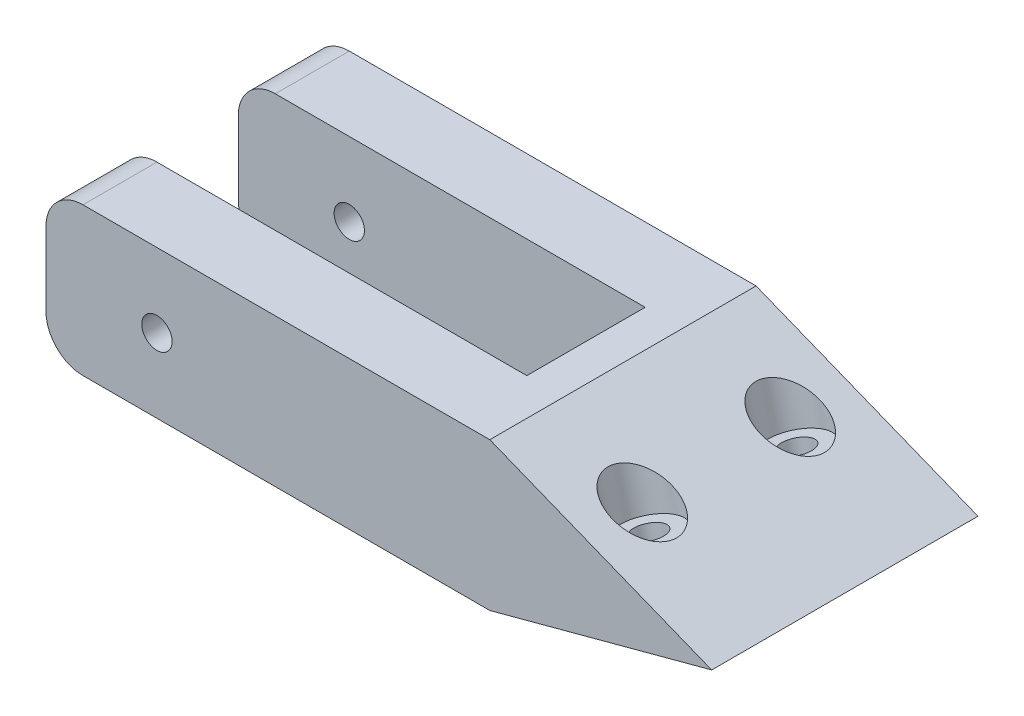
ISO-10303-21;
HEADER;
FILE_DESCRIPTION(('STEP AP214'),'2;1');
FILE_NAME('part.step','',(''),(''),'','','');
FILE_SCHEMA(('AUTOMOTIVE_DESIGN { 1 0 10303 214 1 1 1 1 }'));
ENDSEC;
DATA;
#1=APPLICATION_CONTEXT('core data for automotive mechanical design processes');
#2=APPLICATION_PROTOCOL_DEFINITION('international standard','automotive_design',2000,#1);
#3=PRODUCT_CONTEXT('',#1,'mechanical');
#4=PRODUCT('Part','Part','',(#3));
#5=PRODUCT_RELATED_PRODUCT_CATEGORY('part','',(#4));
#6=PRODUCT_DEFINITION_FORMATION('','',#4);
#7=PRODUCT_DEFINITION_CONTEXT('part definition',#1,'design');
#8=PRODUCT_DEFINITION('design','',#6,#7);
#9=PRODUCT_DEFINITION_SHAPE('','',#8);
#10=(LENGTH_UNIT() NAMED_UNIT(*) SI_UNIT(.MILLI.,.METRE.));
#11=(NAMED_UNIT(*) PLANE_ANGLE_UNIT() SI_UNIT($,.RADIAN.));
#12=(NAMED_UNIT(*) SI_UNIT($,.STERADIAN.) SOLID_ANGLE_UNIT());
#13=UNCERTAINTY_MEASURE_WITH_UNIT(LENGTH_MEASURE(1.E-05),#10,'distance_accuracy_value','');
#14=(GEOMETRIC_REPRESENTATION_CONTEXT(3) GLOBAL_UNCERTAINTY_ASSIGNED_CONTEXT((#13)) GLOBAL_UNIT_ASSIGNED_CONTEXT((#10,
#11,#12)) REPRESENTATION_CONTEXT('',''));
#15=CARTESIAN_POINT('',(0.,0.,0.));
#16=DIRECTION('',(0.,0.,1.));
#17=DIRECTION('',(1.,0.,0.));
#18=AXIS2_PLACEMENT_3D('',#15,#16,#17);
#19=CARTESIAN_POINT('',(51.491557731899,27.8176271469422,-2.));
#20=DIRECTION('',(0.258819045102521,-0.965925826289068,0.));
#21=DIRECTION('',(0.965925826289068,0.258819045102521,0.));
#22=AXIS2_PLACEMENT_3D('',#19,#20,#21);
#23=CYLINDRICAL_SURFACE('',#22,4.00000000000001);
#24=CARTESIAN_POINT('',(57.6133351267968,4.97084287655714,-2.));
#25=DIRECTION('',(0.370363447941102,0.928886923381516,0.));
#26=DIRECTION('',(0.928886923381516,-0.370363447941102,0.));
#27=AXIS2_PLACEMENT_3D('',#24,#25,#26);
#28=ELLIPSE('',#27,4.99139760662046,4.00000000000001);
#29=CARTESIAN_POINT('',(62.2497790929843,3.12221164892422,-2.));
#30=VERTEX_POINT('',#29);
#31=EDGE_CURVE('E209',#30,#30,#28,.F.);
#32=ORIENTED_EDGE('',*,*,#31,.F.);
#33=EDGE_LOOP('',(#32));
#34=FACE_BOUND('',#33,.T.);
#35=CARTESIAN_POINT('',(58.4405602448438,1.88359670670842,-2.));
#36=DIRECTION('',(0.258819045102521,-0.965925826289068,0.));
#37=DIRECTION('',(0.965925826289068,0.258819045102521,0.));
#38=AXIS2_PLACEMENT_3D('',#35,#36,#37);
#39=CIRCLE('',#38,4.00000000000001);
#40=CARTESIAN_POINT('',(62.3042635500001,2.9188728871185,-2.));
#41=VERTEX_POINT('',#40);
#42=EDGE_CURVE('E11',#41,#41,#39,.F.);
#43=ORIENTED_EDGE('',*,*,#42,.F.);
#44=EDGE_LOOP('',(#43));
#45=FACE_BOUND('',#44,.T.);
#46=ADVANCED_FACE('F43',(#34,#45),#23,.F.);
#47=CARTESIAN_POINT('',(0.,10.,-10.));
#48=DIRECTION('',(0.,-1.,0.));
#49=DIRECTION('',(1.,0.,0.));
#50=AXIS2_PLACEMENT_3D('',#47,#48,#49);
#51=PLANE('',#50);
#52=DIRECTION('',(1.,0.,0.));
#53=VECTOR('',#52,1.);
#54=CARTESIAN_POINT('',(0.,10.,0.));
#55=LINE('',#54,#53);
#56=CARTESIAN_POINT('',(-10.,10.,0.));
#57=VERTEX_POINT('',#56);
#58=CARTESIAN_POINT('',(40.,10.,0.));
#59=VERTEX_POINT('',#58);
#60=EDGE_CURVE('E150',#57,#59,#55,.T.);
#61=ORIENTED_EDGE('',*,*,#60,.T.);
#62=DIRECTION('',(0.,0.,-1.));
#63=VECTOR('',#62,1.);
#64=CARTESIAN_POINT('',(40.,10.,8.));
#65=LINE('',#64,#63);
#66=CARTESIAN_POINT('',(40.,10.,16.));
#67=VERTEX_POINT('',#66);
#68=EDGE_CURVE('E154',#67,#59,#65,.T.);
#69=ORIENTED_EDGE('',*,*,#68,.F.);
#70=DIRECTION('',(1.,0.,0.));
#71=VECTOR('',#70,1.);
#72=CARTESIAN_POINT('',(0.,10.,16.));
#73=LINE('',#72,#71);
#74=CARTESIAN_POINT('',(-10.,10.,16.));
#75=VERTEX_POINT('',#74);
#76=EDGE_CURVE('E259',#75,#67,#73,.T.);
#77=ORIENTED_EDGE('',*,*,#76,.F.);
#78=DIRECTION('',(0.,0.,-1.));
#79=VECTOR('',#78,1.);
#80=CARTESIAN_POINT('',(-10.,10.,26.));
#81=LINE('',#80,#79);
#82=CARTESIAN_POINT('',(-10.,10.,26.));
#83=VERTEX_POINT('',#82);
#84=EDGE_CURVE('E226',#83,#75,#81,.T.);
#85=ORIENTED_EDGE('',*,*,#84,.F.);
#86=DIRECTION('',(1.,0.,0.));
#87=VECTOR('',#86,1.);
#88=CARTESIAN_POINT('',(0.,10.,26.));
#89=LINE('',#88,#87);
#90=CARTESIAN_POINT('',(45.,10.,26.));
#91=VERTEX_POINT('',#90);
#92=EDGE_CURVE('E246',#83,#91,#89,.T.);
#93=ORIENTED_EDGE('',*,*,#92,.T.);
#94=DIRECTION('',(0.,0.,1.));
#95=VECTOR('',#94,1.);
#96=CARTESIAN_POINT('',(45.,10.,-10.));
#97=LINE('',#96,#95);
#98=CARTESIAN_POINT('',(45.,10.,-10.));
#99=VERTEX_POINT('',#98);
#100=EDGE_CURVE('E53',#99,#91,#97,.T.);
#101=ORIENTED_EDGE('',*,*,#100,.F.);
#102=DIRECTION('',(1.,0.,0.));
#103=VECTOR('',#102,1.);
#104=CARTESIAN_POINT('',(0.,10.,-10.));
#105=LINE('',#104,#103);
#106=CARTESIAN_POINT('',(-10.,10.,-10.));
#107=VERTEX_POINT('',#106);
#108=EDGE_CURVE('E69',#107,#99,#105,.T.);
#109=ORIENTED_EDGE('',*,*,#108,.F.);
#110=DIRECTION('',(0.,0.,1.));
#111=VECTOR('',#110,1.);
#112=CARTESIAN_POINT('',(-10.,10.,-10.));
#113=LINE('',#112,#111);
#114=EDGE_CURVE('E100',#107,#57,#113,.T.);
#115=ORIENTED_EDGE('',*,*,#114,.T.);
#116=EDGE_LOOP('',(#61,#69,#77,#85,#93,#101,#109,#115));
#117=FACE_BOUND('',#116,.T.);
#118=ADVANCED_FACE('F45',(#117),#51,.F.);
#119=CARTESIAN_POINT('',(9.61286639759677,24.1094685303859,-10.));
#120=DIRECTION('',(0.370363447941102,0.928886923381516,0.));
#121=DIRECTION('',(-0.928886923381516,0.370363447941102,0.));
#122=AXIS2_PLACEMENT_3D('',#119,#120,#121);
#123=PLANE('',#122);
#124=ORIENTED_EDGE('',*,*,#31,.T.);
#125=EDGE_LOOP('',(#124));
#126=FACE_BOUND('',#125,.T.);
#127=ORIENTED_EDGE('',*,*,#100,.T.);
#128=DIRECTION('',(-0.928886923381516,0.370363447941102,0.));
#129=VECTOR('',#128,1.);
#130=CARTESIAN_POINT('',(9.61286639759677,24.1094685303859,26.));
#131=LINE('',#130,#129);
#132=CARTESIAN_POINT('',(75.,-1.96152422706629,26.));
#133=VERTEX_POINT('',#132);
#134=EDGE_CURVE('E231',#133,#91,#131,.T.);
#135=ORIENTED_EDGE('',*,*,#134,.F.);
#136=DIRECTION('',(0.,0.,1.));
#137=VECTOR('',#136,1.);
#138=CARTESIAN_POINT('',(75.,-1.96152422706629,-10.));
#139=LINE('',#138,#137);
#140=CARTESIAN_POINT('',(75.,-1.96152422706629,-10.));
#141=VERTEX_POINT('',#140);
#142=EDGE_CURVE('E129',#141,#133,#139,.T.);
#143=ORIENTED_EDGE('',*,*,#142,.F.);
#144=DIRECTION('',(-0.928886923381516,0.370363447941102,0.));
#145=VECTOR('',#144,1.);
#146=CARTESIAN_POINT('',(9.61286639759677,24.1094685303859,-10.));
#147=LINE('',#146,#145);
#148=EDGE_CURVE('E136',#141,#99,#147,.T.);
#149=ORIENTED_EDGE('',*,*,#148,.T.);
#150=EDGE_LOOP('',(#127,#135,#143,#149));
#151=FACE_BOUND('',#150,.T.);
#152=CARTESIAN_POINT('',(57.6133351267968,4.97084287655714,18.));
#153=DIRECTION('',(-0.370363447941102,-0.928886923381516,0.));
#154=DIRECTION('',(0.928886923381516,-0.370363447941102,0.));
#155=AXIS2_PLACEMENT_3D('',#152,#153,#154);
#156=ELLIPSE('',#155,4.99139760662046,4.00000000000001);
#157=CARTESIAN_POINT('',(62.2497790929843,3.12221164892422,18.));
#158=VERTEX_POINT('',#157);
#159=EDGE_CURVE('E290',#158,#158,#156,.F.);
#160=ORIENTED_EDGE('',*,*,#159,.F.);
#161=EDGE_LOOP('',(#160));
#162=FACE_BOUND('',#161,.T.);
#163=ADVANCED_FACE('F337',(#126,#151,#162),#123,.T.);
#164=CARTESIAN_POINT('',(5.51442841485016,-20.5801270189222,-10.));
#165=DIRECTION('',(0.258819045102522,-0.965925826289068,0.));
#166=DIRECTION('',(0.965925826289068,0.258819045102522,0.));
#167=AXIS2_PLACEMENT_3D('',#164,#165,#166);
#168=PLANE('',#167);
#169=ORIENTED_EDGE('',*,*,#142,.T.);
#170=DIRECTION('',(0.965925826289068,0.258819045102522,0.));
#171=VECTOR('',#170,1.);
#172=CARTESIAN_POINT('',(5.51442841485016,-20.5801270189222,26.));
#173=LINE('',#172,#171);
#174=CARTESIAN_POINT('',(45.,-10.,26.));
#175=VERTEX_POINT('',#174);
#176=EDGE_CURVE('E123',#175,#133,#173,.T.);
#177=ORIENTED_EDGE('',*,*,#176,.F.);
#178=DIRECTION('',(0.,0.,1.));
#179=VECTOR('',#178,1.);
#180=CARTESIAN_POINT('',(45.,-10.,-10.));
#181=LINE('',#180,#179);
#182=CARTESIAN_POINT('',(45.,-10.,-10.));
#183=VERTEX_POINT('',#182);
#184=EDGE_CURVE('E115',#183,#175,#181,.T.);
#185=ORIENTED_EDGE('',*,*,#184,.F.);
#186=DIRECTION('',(0.965925826289068,0.258819045102522,0.));
#187=VECTOR('',#186,1.);
#188=CARTESIAN_POINT('',(5.51442841485016,-20.5801270189222,-10.));
#189=LINE('',#188,#187);
#190=EDGE_CURVE('E120',#183,#141,#189,.T.);
#191=ORIENTED_EDGE('',*,*,#190,.T.);
#192=EDGE_LOOP('',(#169,#177,#185,#191));
#193=FACE_BOUND('',#192,.T.);
#194=CARTESIAN_POINT('',(60.511112605664,-5.84380990360413,-2.));
#195=DIRECTION('',(0.258819045102521,-0.965925826289068,0.));
#196=DIRECTION('',(0.965925826289068,0.258819045102521,0.));
#197=AXIS2_PLACEMENT_3D('',#194,#195,#196);
#198=CIRCLE('',#197,2.10000000000001);
#199=CARTESIAN_POINT('',(62.539556840871,-5.30028990888883,-2.));
#200=VERTEX_POINT('',#199);
#201=EDGE_CURVE('E214',#200,#200,#198,.T.);
#202=ORIENTED_EDGE('',*,*,#201,.F.);
#203=EDGE_LOOP('',(#202));
#204=FACE_BOUND('',#203,.T.);
#205=CARTESIAN_POINT('',(60.511112605664,-5.84380990360413,18.));
#206=DIRECTION('',(-0.258819045102521,0.965925826289068,0.));
#207=DIRECTION('',(0.965925826289068,0.258819045102521,0.));
#208=AXIS2_PLACEMENT_3D('',#205,#206,#207);
#209=CIRCLE('',#208,2.10000000000001);
#210=CARTESIAN_POINT('',(62.539556840871,-5.30028990888883,18.));
#211=VERTEX_POINT('',#210);
#212=EDGE_CURVE('E295',#211,#211,#209,.T.);
#213=ORIENTED_EDGE('',*,*,#212,.T.);
#214=EDGE_LOOP('',(#213));
#215=FACE_BOUND('',#214,.T.);
#216=ADVANCED_FACE('F118',(#193,#204,#215),#168,.T.);
#217=CARTESIAN_POINT('',(0.,-10.,-10.));
#218=DIRECTION('',(0.,-1.,0.));
#219=DIRECTION('',(1.,0.,0.));
#220=AXIS2_PLACEMENT_3D('',#217,#218,#219);
#221=PLANE('',#220);
#222=DIRECTION('',(1.,0.,0.));
#223=VECTOR('',#222,1.);
#224=CARTESIAN_POINT('',(0.,-10.,0.));
#225=LINE('',#224,#223);
#226=CARTESIAN_POINT('',(-10.,-10.,0.));
#227=VERTEX_POINT('',#226);
#228=CARTESIAN_POINT('',(40.,-10.,0.));
#229=VERTEX_POINT('',#228);
#230=EDGE_CURVE('E166',#227,#229,#225,.T.);
#231=ORIENTED_EDGE('',*,*,#230,.F.);
#232=DIRECTION('',(0.,0.,1.));
#233=VECTOR('',#232,1.);
#234=CARTESIAN_POINT('',(-10.,-10.,-10.));
#235=LINE('',#234,#233);
#236=CARTESIAN_POINT('',(-10.,-10.,-10.));
#237=VERTEX_POINT('',#236);
#238=EDGE_CURVE('E92',#237,#227,#235,.T.);
#239=ORIENTED_EDGE('',*,*,#238,.F.);
#240=DIRECTION('',(1.,0.,0.));
#241=VECTOR('',#240,1.);
#242=CARTESIAN_POINT('',(0.,-10.,-10.));
#243=LINE('',#242,#241);
#244=EDGE_CURVE('E134',#237,#183,#243,.T.);
#245=ORIENTED_EDGE('',*,*,#244,.T.);
#246=ORIENTED_EDGE('',*,*,#184,.T.);
#247=DIRECTION('',(1.,0.,0.));
#248=VECTOR('',#247,1.);
#249=CARTESIAN_POINT('',(0.,-10.,26.));
#250=LINE('',#249,#248);
#251=CARTESIAN_POINT('',(-10.,-10.,26.));
#252=VERTEX_POINT('',#251);
#253=EDGE_CURVE('E269',#252,#175,#250,.T.);
#254=ORIENTED_EDGE('',*,*,#253,.F.);
#255=DIRECTION('',(0.,0.,-1.));
#256=VECTOR('',#255,1.);
#257=CARTESIAN_POINT('',(-10.,-10.,26.));
#258=LINE('',#257,#256);
#259=CARTESIAN_POINT('',(-10.,-10.,16.));
#260=VERTEX_POINT('',#259);
#261=EDGE_CURVE('E225',#252,#260,#258,.T.);
#262=ORIENTED_EDGE('',*,*,#261,.T.);
#263=DIRECTION('',(1.,0.,0.));
#264=VECTOR('',#263,1.);
#265=CARTESIAN_POINT('',(0.,-10.,16.));
#266=LINE('',#265,#264);
#267=CARTESIAN_POINT('',(40.,-10.,16.));
#268=VERTEX_POINT('',#267);
#269=EDGE_CURVE('E242',#260,#268,#266,.T.);
#270=ORIENTED_EDGE('',*,*,#269,.T.);
#271=DIRECTION('',(0.,0.,-1.));
#272=VECTOR('',#271,1.);
#273=CARTESIAN_POINT('',(40.,-10.,8.));
#274=LINE('',#273,#272);
#275=EDGE_CURVE('E203',#268,#229,#274,.T.);
#276=ORIENTED_EDGE('',*,*,#275,.T.);
#277=EDGE_LOOP('',(#231,#239,#245,#246,#254,#262,#270,#276));
#278=FACE_BOUND('',#277,.T.);
#279=ADVANCED_FACE('F139',(#278),#221,.T.);
#280=CARTESIAN_POINT('',(-10.,-5.,-10.));
#281=DIRECTION('',(0.,0.,1.));
#282=DIRECTION('',(1.,0.,0.));
#283=AXIS2_PLACEMENT_3D('',#280,#281,#282);
#284=CYLINDRICAL_SURFACE('',#283,5.);
#285=CARTESIAN_POINT('',(-10.,-5.,0.));
#286=DIRECTION('',(0.,0.,1.));
#287=DIRECTION('',(1.,0.,0.));
#288=AXIS2_PLACEMENT_3D('',#285,#286,#287);
#289=CIRCLE('',#288,5.);
#290=CARTESIAN_POINT('',(-15.,-4.99999999999993,0.));
#291=VERTEX_POINT('',#290);
#292=EDGE_CURVE('E162',#291,#227,#289,.T.);
#293=ORIENTED_EDGE('',*,*,#292,.F.);
#294=DIRECTION('',(0.,0.,1.));
#295=VECTOR('',#294,1.);
#296=CARTESIAN_POINT('',(-15.,-4.99999999999993,-10.));
#297=LINE('',#296,#295);
#298=CARTESIAN_POINT('',(-15.,-4.99999999999993,-10.));
#299=VERTEX_POINT('',#298);
#300=EDGE_CURVE('E176',#299,#291,#297,.T.);
#301=ORIENTED_EDGE('',*,*,#300,.F.);
#302=CARTESIAN_POINT('',(-10.,-5.,-10.));
#303=DIRECTION('',(0.,0.,1.));
#304=DIRECTION('',(1.,0.,0.));
#305=AXIS2_PLACEMENT_3D('',#302,#303,#304);
#306=CIRCLE('',#305,5.);
#307=EDGE_CURVE('E141',#299,#237,#306,.T.);
#308=ORIENTED_EDGE('',*,*,#307,.T.);
#309=ORIENTED_EDGE('',*,*,#238,.T.);
#310=EDGE_LOOP('',(#293,#301,#308,#309));
#311=FACE_BOUND('',#310,.T.);
#312=ADVANCED_FACE('F194',(#311),#284,.T.);
#313=CARTESIAN_POINT('',(-15.,0.,-10.));
#314=DIRECTION('',(-1.,0.,0.));
#315=DIRECTION('',(0.,0.,1.));
#316=AXIS2_PLACEMENT_3D('',#313,#314,#315);
#317=PLANE('',#316);
#318=DIRECTION('',(0.,-1.,0.));
#319=VECTOR('',#318,1.);
#320=CARTESIAN_POINT('',(-15.,0.,0.));
#321=LINE('',#320,#319);
#322=CARTESIAN_POINT('',(-15.,4.99999999999993,0.));
#323=VERTEX_POINT('',#322);
#324=EDGE_CURVE('E158',#323,#291,#321,.T.);
#325=ORIENTED_EDGE('',*,*,#324,.F.);
#326=DIRECTION('',(0.,0.,1.));
#327=VECTOR('',#326,1.);
#328=CARTESIAN_POINT('',(-15.,4.99999999999993,-10.));
#329=LINE('',#328,#327);
#330=CARTESIAN_POINT('',(-15.,4.99999999999993,-10.));
#331=VERTEX_POINT('',#330);
#332=EDGE_CURVE('E179',#331,#323,#329,.T.);
#333=ORIENTED_EDGE('',*,*,#332,.F.);
#334=DIRECTION('',(0.,-1.,0.));
#335=VECTOR('',#334,1.);
#336=CARTESIAN_POINT('',(-15.,0.,-10.));
#337=LINE('',#336,#335);
#338=EDGE_CURVE('E144',#331,#299,#337,.T.);
#339=ORIENTED_EDGE('',*,*,#338,.T.);
#340=ORIENTED_EDGE('',*,*,#300,.T.);
#341=EDGE_LOOP('',(#325,#333,#339,#340));
#342=FACE_BOUND('',#341,.T.);
#343=ADVANCED_FACE('F193',(#342),#317,.T.);
#344=CARTESIAN_POINT('',(-10.,5.,-10.));
#345=DIRECTION('',(0.,0.,1.));
#346=DIRECTION('',(1.,0.,0.));
#347=AXIS2_PLACEMENT_3D('',#344,#345,#346);
#348=CYLINDRICAL_SURFACE('',#347,5.);
#349=CARTESIAN_POINT('',(-10.,5.,0.));
#350=DIRECTION('',(0.,0.,1.));
#351=DIRECTION('',(1.,0.,0.));
#352=AXIS2_PLACEMENT_3D('',#349,#350,#351);
#353=CIRCLE('',#352,5.);
#354=EDGE_CURVE('E153',#57,#323,#353,.T.);
#355=ORIENTED_EDGE('',*,*,#354,.F.);
#356=ORIENTED_EDGE('',*,*,#114,.F.);
#357=CARTESIAN_POINT('',(-10.,5.,-10.));
#358=DIRECTION('',(0.,0.,1.));
#359=DIRECTION('',(1.,0.,0.));
#360=AXIS2_PLACEMENT_3D('',#357,#358,#359);
#361=CIRCLE('',#360,5.);
#362=EDGE_CURVE('E189',#107,#331,#361,.T.);
#363=ORIENTED_EDGE('',*,*,#362,.T.);
#364=ORIENTED_EDGE('',*,*,#332,.T.);
#365=EDGE_LOOP('',(#355,#356,#363,#364));
#366=FACE_BOUND('',#365,.T.);
#367=ADVANCED_FACE('F187',(#366),#348,.T.);
#368=CARTESIAN_POINT('',(0.,0.,-10.));
#369=DIRECTION('',(0.,0.,1.));
#370=DIRECTION('',(1.,0.,0.));
#371=AXIS2_PLACEMENT_3D('',#368,#369,#370);
#372=PLANE('',#371);
#373=ORIENTED_EDGE('',*,*,#108,.T.);
#374=ORIENTED_EDGE('',*,*,#148,.F.);
#375=ORIENTED_EDGE('',*,*,#190,.F.);
#376=ORIENTED_EDGE('',*,*,#244,.F.);
#377=ORIENTED_EDGE('',*,*,#307,.F.);
#378=ORIENTED_EDGE('',*,*,#338,.F.);
#379=ORIENTED_EDGE('',*,*,#362,.F.);
#380=EDGE_LOOP('',(#373,#374,#375,#376,#377,#378,#379));
#381=FACE_BOUND('',#380,.T.);
#382=ADVANCED_FACE('F132',(#381),#372,.F.);
#383=CARTESIAN_POINT('',(0.,0.,0.));
#384=DIRECTION('',(0.,0.,1.));
#385=DIRECTION('',(1.,0.,0.));
#386=AXIS2_PLACEMENT_3D('',#383,#384,#385);
#387=PLANE('',#386);
#388=CARTESIAN_POINT('',(0.,0.,0.));
#389=DIRECTION('',(0.,0.,1.));
#390=DIRECTION('',(1.,0.,0.));
#391=AXIS2_PLACEMENT_3D('',#388,#389,#390);
#392=CIRCLE('',#391,2.05);
#393=CARTESIAN_POINT('',(2.05,0.,0.));
#394=VERTEX_POINT('',#393);
#395=EDGE_CURVE('E299',#394,#394,#392,.F.);
#396=ORIENTED_EDGE('',*,*,#395,.T.);
#397=EDGE_LOOP('',(#396));
#398=FACE_BOUND('',#397,.T.);
#399=DIRECTION('',(0.,-1.,0.));
#400=VECTOR('',#399,1.);
#401=CARTESIAN_POINT('',(40.,0.,0.));
#402=LINE('',#401,#400);
#403=EDGE_CURVE('E60',#59,#229,#402,.T.);
#404=ORIENTED_EDGE('',*,*,#403,.F.);
#405=ORIENTED_EDGE('',*,*,#60,.F.);
#406=ORIENTED_EDGE('',*,*,#354,.T.);
#407=ORIENTED_EDGE('',*,*,#324,.T.);
#408=ORIENTED_EDGE('',*,*,#292,.T.);
#409=ORIENTED_EDGE('',*,*,#230,.T.);
#410=EDGE_LOOP('',(#404,#405,#406,#407,#408,#409));
#411=FACE_BOUND('',#410,.T.);
#412=ADVANCED_FACE('F186',(#398,#411),#387,.T.);
#413=CARTESIAN_POINT('',(40.,0.,8.));
#414=DIRECTION('',(1.,0.,0.));
#415=DIRECTION('',(0.,0.,-1.));
#416=AXIS2_PLACEMENT_3D('',#413,#414,#415);
#417=PLANE('',#416);
#418=ORIENTED_EDGE('',*,*,#403,.T.);
#419=ORIENTED_EDGE('',*,*,#275,.F.);
#420=DIRECTION('',(0.,-1.,0.));
#421=VECTOR('',#420,1.);
#422=CARTESIAN_POINT('',(40.,0.,16.));
#423=LINE('',#422,#421);
#424=EDGE_CURVE('E263',#67,#268,#423,.T.);
#425=ORIENTED_EDGE('',*,*,#424,.F.);
#426=ORIENTED_EDGE('',*,*,#68,.T.);
#427=EDGE_LOOP('',(#418,#419,#425,#426));
#428=FACE_BOUND('',#427,.T.);
#429=ADVANCED_FACE('F344',(#428),#417,.F.);
#430=CARTESIAN_POINT('',(58.4405602448438,1.88359670670842,-2.));
#431=DIRECTION('',(0.258819045102521,-0.965925826289068,0.));
#432=DIRECTION('',(0.965925826289068,0.258819045102521,0.));
#433=AXIS2_PLACEMENT_3D('',#430,#431,#432);
#434=PLANE('',#433);
#435=CARTESIAN_POINT('',(58.4405602448438,1.88359670670842,-2.));
#436=DIRECTION('',(0.258819045102521,-0.965925826289068,0.));
#437=DIRECTION('',(0.965925826289068,0.258819045102521,0.));
#438=AXIS2_PLACEMENT_3D('',#435,#436,#437);
#439=CIRCLE('',#438,2.10000000000001);
#440=CARTESIAN_POINT('',(60.4690044800509,2.42711670142371,-2.));
#441=VERTEX_POINT('',#440);
#442=EDGE_CURVE('E213',#441,#441,#439,.T.);
#443=ORIENTED_EDGE('',*,*,#442,.T.);
#444=EDGE_LOOP('',(#443));
#445=FACE_BOUND('',#444,.T.);
#446=ORIENTED_EDGE('',*,*,#42,.T.);
#447=EDGE_LOOP('',(#446));
#448=FACE_BOUND('',#447,.T.);
#449=ADVANCED_FACE('F342',(#445,#448),#434,.F.);
#450=CARTESIAN_POINT('',(58.4405602448438,1.88359670670842,-2.));
#451=DIRECTION('',(0.258819045102521,-0.965925826289068,0.));
#452=DIRECTION('',(0.965925826289068,0.258819045102521,0.));
#453=AXIS2_PLACEMENT_3D('',#450,#451,#452);
#454=CYLINDRICAL_SURFACE('',#453,2.10000000000001);
#455=ORIENTED_EDGE('',*,*,#442,.F.);
#456=EDGE_LOOP('',(#455));
#457=FACE_BOUND('',#456,.T.);
#458=ORIENTED_EDGE('',*,*,#201,.T.);
#459=EDGE_LOOP('',(#458));
#460=FACE_BOUND('',#459,.T.);
#461=ADVANCED_FACE('F393',(#457,#460),#454,.F.);
#462=CARTESIAN_POINT('',(51.491557731899,27.8176271469422,18.));
#463=DIRECTION('',(0.258819045102521,-0.965925826289068,0.));
#464=DIRECTION('',(0.965925826289068,0.258819045102521,0.));
#465=AXIS2_PLACEMENT_3D('',#462,#463,#464);
#466=CYLINDRICAL_SURFACE('',#465,4.00000000000001);
#467=ORIENTED_EDGE('',*,*,#159,.T.);
#468=EDGE_LOOP('',(#467));
#469=FACE_BOUND('',#468,.T.);
#470=CARTESIAN_POINT('',(58.4405602448438,1.88359670670842,18.));
#471=DIRECTION('',(-0.258819045102521,0.965925826289068,0.));
#472=DIRECTION('',(0.965925826289068,0.258819045102521,0.));
#473=AXIS2_PLACEMENT_3D('',#470,#471,#472);
#474=CIRCLE('',#473,4.00000000000001);
#475=CARTESIAN_POINT('',(62.3042635500001,2.9188728871185,18.));
#476=VERTEX_POINT('',#475);
#477=EDGE_CURVE('E218',#476,#476,#474,.F.);
#478=ORIENTED_EDGE('',*,*,#477,.T.);
#479=EDGE_LOOP('',(#478));
#480=FACE_BOUND('',#479,.T.);
#481=ADVANCED_FACE('F401',(#469,#480),#466,.F.);
#482=CARTESIAN_POINT('',(-10.,-5.,26.));
#483=DIRECTION('',(0.,0.,-1.));
#484=DIRECTION('',(1.,0.,0.));
#485=AXIS2_PLACEMENT_3D('',#482,#483,#484);
#486=CYLINDRICAL_SURFACE('',#485,5.);
#487=CARTESIAN_POINT('',(-10.,-5.,16.));
#488=DIRECTION('',(0.,0.,1.));
#489=DIRECTION('',(1.,0.,0.));
#490=AXIS2_PLACEMENT_3D('',#487,#488,#489);
#491=CIRCLE('',#490,5.);
#492=CARTESIAN_POINT('',(-15.,-4.99999999999993,16.));
#493=VERTEX_POINT('',#492);
#494=EDGE_CURVE('E247',#493,#260,#491,.T.);
#495=ORIENTED_EDGE('',*,*,#494,.T.);
#496=ORIENTED_EDGE('',*,*,#261,.F.);
#497=CARTESIAN_POINT('',(-10.,-5.,26.));
#498=DIRECTION('',(0.,0.,1.));
#499=DIRECTION('',(1.,0.,0.));
#500=AXIS2_PLACEMENT_3D('',#497,#498,#499);
#501=CIRCLE('',#500,5.);
#502=CARTESIAN_POINT('',(-15.,-4.99999999999993,26.));
#503=VERTEX_POINT('',#502);
#504=EDGE_CURVE('E272',#503,#252,#501,.T.);
#505=ORIENTED_EDGE('',*,*,#504,.F.);
#506=DIRECTION('',(0.,0.,-1.));
#507=VECTOR('',#506,1.);
#508=CARTESIAN_POINT('',(-15.,-4.99999999999993,26.));
#509=LINE('',#508,#507);
#510=EDGE_CURVE('E235',#503,#493,#509,.T.);
#511=ORIENTED_EDGE('',*,*,#510,.T.);
#512=EDGE_LOOP('',(#495,#496,#505,#511));
#513=FACE_BOUND('',#512,.T.);
#514=ADVANCED_FACE('F409',(#513),#486,.T.);
#515=CARTESIAN_POINT('',(-15.,0.,26.));
#516=DIRECTION('',(-1.,0.,0.));
#517=DIRECTION('',(0.,0.,-1.));
#518=AXIS2_PLACEMENT_3D('',#515,#516,#517);
#519=PLANE('',#518);
#520=DIRECTION('',(0.,-1.,0.));
#521=VECTOR('',#520,1.);
#522=CARTESIAN_POINT('',(-15.,0.,16.));
#523=LINE('',#522,#521);
#524=CARTESIAN_POINT('',(-15.,4.99999999999993,16.));
#525=VERTEX_POINT('',#524);
#526=EDGE_CURVE('E251',#525,#493,#523,.T.);
#527=ORIENTED_EDGE('',*,*,#526,.T.);
#528=ORIENTED_EDGE('',*,*,#510,.F.);
#529=DIRECTION('',(0.,-1.,0.));
#530=VECTOR('',#529,1.);
#531=CARTESIAN_POINT('',(-15.,0.,26.));
#532=LINE('',#531,#530);
#533=CARTESIAN_POINT('',(-15.,4.99999999999993,26.));
#534=VERTEX_POINT('',#533);
#535=EDGE_CURVE('E276',#534,#503,#532,.T.);
#536=ORIENTED_EDGE('',*,*,#535,.F.);
#537=DIRECTION('',(0.,0.,-1.));
#538=VECTOR('',#537,1.);
#539=CARTESIAN_POINT('',(-15.,4.99999999999993,26.));
#540=LINE('',#539,#538);
#541=EDGE_CURVE('E230',#534,#525,#540,.T.);
#542=ORIENTED_EDGE('',*,*,#541,.T.);
#543=EDGE_LOOP('',(#527,#528,#536,#542));
#544=FACE_BOUND('',#543,.T.);
#545=ADVANCED_FACE('F417',(#544),#519,.T.);
#546=CARTESIAN_POINT('',(-10.,5.,26.));
#547=DIRECTION('',(0.,0.,-1.));
#548=DIRECTION('',(1.,0.,0.));
#549=AXIS2_PLACEMENT_3D('',#546,#547,#548);
#550=CYLINDRICAL_SURFACE('',#549,5.);
#551=CARTESIAN_POINT('',(-10.,5.,16.));
#552=DIRECTION('',(0.,0.,1.));
#553=DIRECTION('',(1.,0.,0.));
#554=AXIS2_PLACEMENT_3D('',#551,#552,#553);
#555=CIRCLE('',#554,5.);
#556=EDGE_CURVE('E255',#75,#525,#555,.T.);
#557=ORIENTED_EDGE('',*,*,#556,.T.);
#558=ORIENTED_EDGE('',*,*,#541,.F.);
#559=CARTESIAN_POINT('',(-10.,5.,26.));
#560=DIRECTION('',(0.,0.,1.));
#561=DIRECTION('',(1.,0.,0.));
#562=AXIS2_PLACEMENT_3D('',#559,#560,#561);
#563=CIRCLE('',#562,5.);
#564=EDGE_CURVE('E280',#83,#534,#563,.T.);
#565=ORIENTED_EDGE('',*,*,#564,.F.);
#566=ORIENTED_EDGE('',*,*,#84,.T.);
#567=EDGE_LOOP('',(#557,#558,#565,#566));
#568=FACE_BOUND('',#567,.T.);
#569=ADVANCED_FACE('F425',(#568),#550,.T.);
#570=CARTESIAN_POINT('',(0.,0.,26.));
#571=DIRECTION('',(0.,0.,-1.));
#572=DIRECTION('',(1.,0.,0.));
#573=AXIS2_PLACEMENT_3D('',#570,#571,#572);
#574=PLANE('',#573);
#575=CARTESIAN_POINT('',(0.,0.,26.));
#576=DIRECTION('',(0.,0.,1.));
#577=DIRECTION('',(1.,0.,0.));
#578=AXIS2_PLACEMENT_3D('',#575,#576,#577);
#579=CIRCLE('',#578,2.05);
#580=CARTESIAN_POINT('',(2.05,0.,26.));
#581=VERTEX_POINT('',#580);
#582=EDGE_CURVE('E306',#581,#581,#579,.T.);
#583=ORIENTED_EDGE('',*,*,#582,.F.);
#584=EDGE_LOOP('',(#583));
#585=FACE_BOUND('',#584,.T.);
#586=ORIENTED_EDGE('',*,*,#92,.F.);
#587=ORIENTED_EDGE('',*,*,#564,.T.);
#588=ORIENTED_EDGE('',*,*,#535,.T.);
#589=ORIENTED_EDGE('',*,*,#504,.T.);
#590=ORIENTED_EDGE('',*,*,#253,.T.);
#591=ORIENTED_EDGE('',*,*,#176,.T.);
#592=ORIENTED_EDGE('',*,*,#134,.T.);
#593=EDGE_LOOP('',(#586,#587,#588,#589,#590,#591,#592));
#594=FACE_BOUND('',#593,.T.);
#595=ADVANCED_FACE('F433',(#585,#594),#574,.F.);
#596=CARTESIAN_POINT('',(0.,0.,16.));
#597=DIRECTION('',(0.,0.,-1.));
#598=DIRECTION('',(1.,0.,0.));
#599=AXIS2_PLACEMENT_3D('',#596,#597,#598);
#600=PLANE('',#599);
#601=CARTESIAN_POINT('',(0.,0.,16.));
#602=DIRECTION('',(0.,0.,-1.));
#603=DIRECTION('',(-1.,0.,0.));
#604=AXIS2_PLACEMENT_3D('',#601,#602,#603);
#605=CIRCLE('',#604,2.05);
#606=CARTESIAN_POINT('',(-2.05,0.,16.));
#607=VERTEX_POINT('',#606);
#608=EDGE_CURVE('E47',#607,#607,#605,.F.);
#609=ORIENTED_EDGE('',*,*,#608,.T.);
#610=EDGE_LOOP('',(#609));
#611=FACE_BOUND('',#610,.T.);
#612=ORIENTED_EDGE('',*,*,#424,.T.);
#613=ORIENTED_EDGE('',*,*,#269,.F.);
#614=ORIENTED_EDGE('',*,*,#494,.F.);
#615=ORIENTED_EDGE('',*,*,#526,.F.);
#616=ORIENTED_EDGE('',*,*,#556,.F.);
#617=ORIENTED_EDGE('',*,*,#76,.T.);
#618=EDGE_LOOP('',(#612,#613,#614,#615,#616,#617));
#619=FACE_BOUND('',#618,.T.);
#620=ADVANCED_FACE('F441',(#611,#619),#600,.T.);
#621=CARTESIAN_POINT('',(58.4405602448438,1.88359670670842,18.));
#622=DIRECTION('',(0.258819045102521,-0.965925826289068,0.));
#623=DIRECTION('',(0.965925826289068,0.258819045102521,0.));
#624=AXIS2_PLACEMENT_3D('',#621,#622,#623);
#625=PLANE('',#624);
#626=CARTESIAN_POINT('',(58.4405602448438,1.88359670670842,18.));
#627=DIRECTION('',(-0.258819045102521,0.965925826289068,0.));
#628=DIRECTION('',(0.965925826289068,0.258819045102521,0.));
#629=AXIS2_PLACEMENT_3D('',#626,#627,#628);
#630=CIRCLE('',#629,2.10000000000001);
#631=CARTESIAN_POINT('',(60.4690044800509,2.42711670142371,18.));
#632=VERTEX_POINT('',#631);
#633=EDGE_CURVE('E294',#632,#632,#630,.T.);
#634=ORIENTED_EDGE('',*,*,#633,.F.);
#635=EDGE_LOOP('',(#634));
#636=FACE_BOUND('',#635,.T.);
#637=ORIENTED_EDGE('',*,*,#477,.F.);
#638=EDGE_LOOP('',(#637));
#639=FACE_BOUND('',#638,.T.);
#640=ADVANCED_FACE('F449',(#636,#639),#625,.F.);
#641=CARTESIAN_POINT('',(58.4405602448438,1.88359670670842,18.));
#642=DIRECTION('',(0.258819045102521,-0.965925826289068,0.));
#643=DIRECTION('',(0.965925826289068,0.258819045102521,0.));
#644=AXIS2_PLACEMENT_3D('',#641,#642,#643);
#645=CYLINDRICAL_SURFACE('',#644,2.10000000000001);
#646=ORIENTED_EDGE('',*,*,#633,.T.);
#647=EDGE_LOOP('',(#646));
#648=FACE_BOUND('',#647,.T.);
#649=ORIENTED_EDGE('',*,*,#212,.F.);
#650=EDGE_LOOP('',(#649));
#651=FACE_BOUND('',#650,.T.);
#652=ADVANCED_FACE('F327',(#648,#651),#645,.F.);
#653=CARTESIAN_POINT('',(0.,0.,26.));
#654=DIRECTION('',(0.,0.,-1.));
#655=DIRECTION('',(-1.,0.,0.));
#656=AXIS2_PLACEMENT_3D('',#653,#654,#655);
#657=CYLINDRICAL_SURFACE('',#656,2.05);
#658=ORIENTED_EDGE('',*,*,#608,.F.);
#659=EDGE_LOOP('',(#658));
#660=FACE_BOUND('',#659,.T.);
#661=ORIENTED_EDGE('',*,*,#582,.T.);
#662=EDGE_LOOP('',(#661));
#663=FACE_BOUND('',#662,.T.);
#664=ADVANCED_FACE('F319',(#660,#663),#657,.F.);
#665=ORIENTED_EDGE('',*,*,#395,.F.);
#666=EDGE_LOOP('',(#665));
#667=FACE_BOUND('',#666,.T.);
#668=CARTESIAN_POINT('',(0.,0.,-5.));
#669=DIRECTION('',(0.,0.,1.));
#670=DIRECTION('',(1.,0.,0.));
#671=AXIS2_PLACEMENT_3D('',#668,#669,#670);
#672=CIRCLE('',#671,2.05);
#673=CARTESIAN_POINT('',(2.05,0.,-5.));
#674=VERTEX_POINT('',#673);
#675=EDGE_CURVE('E310',#674,#674,#672,.T.);
#676=ORIENTED_EDGE('',*,*,#675,.F.);
#677=EDGE_LOOP('',(#676));
#678=FACE_BOUND('',#677,.T.);
#679=ADVANCED_FACE('F317',(#667,#678),#657,.F.);
#680=CARTESIAN_POINT('',(0.,0.,-5.));
#681=DIRECTION('',(0.,0.,1.));
#682=DIRECTION('',(1.,0.,0.));
#683=AXIS2_PLACEMENT_3D('',#680,#681,#682);
#684=PLANE('',#683);
#685=ORIENTED_EDGE('',*,*,#675,.T.);
#686=EDGE_LOOP('',(#685));
#687=FACE_BOUND('',#686,.T.);
#688=ADVANCED_FACE('F315',(#687),#684,.T.);
#689=CLOSED_SHELL('',(#46,#118,#163,#216,#279,#312,#343,#367,#382,#412,#429,#449,#461,#481,#514,
#545,#569,#595,#620,#640,#652,#664,#679,#688));
#690=MANIFOLD_SOLID_BREP('B2',#689);
#691=ADVANCED_BREP_SHAPE_REPRESENTATION('',(#18,#690),#14);
#692=SHAPE_DEFINITION_REPRESENTATION(#9,#691);
ENDSEC;
END-ISO-10303-21;
